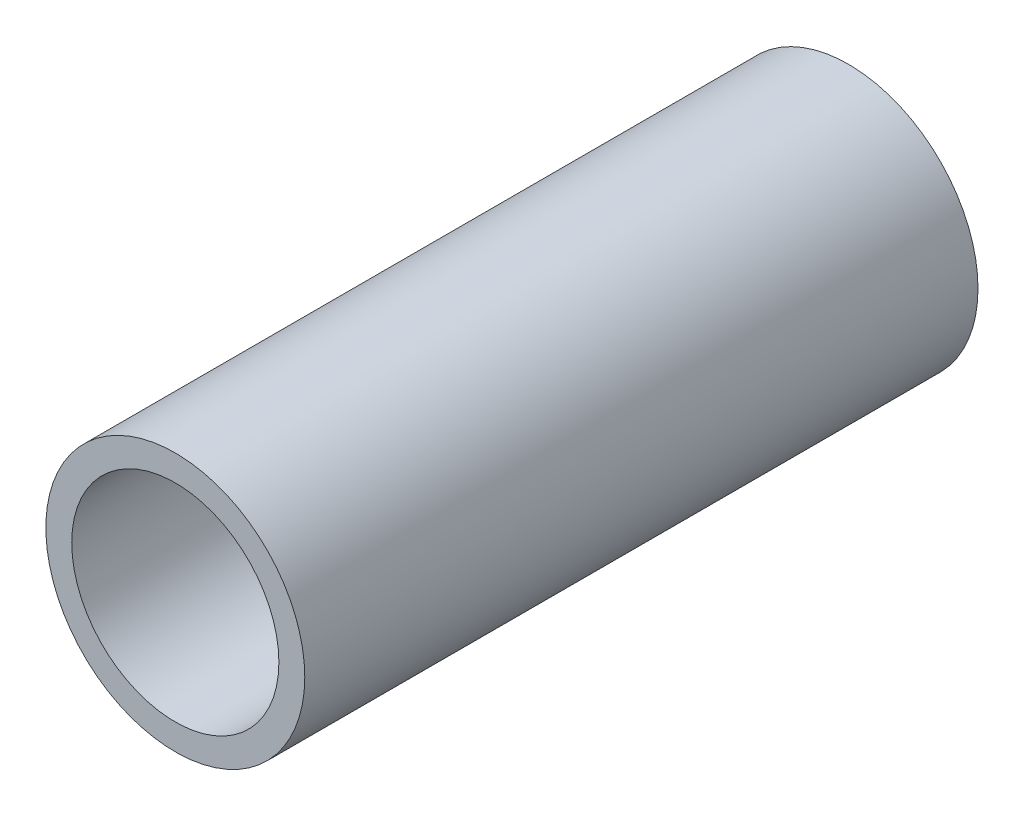
ISO-10303-21;
HEADER;
FILE_DESCRIPTION(('STEP AP214'),'2;1');
FILE_NAME('part.step','',(''),(''),'','','');
FILE_SCHEMA(('AUTOMOTIVE_DESIGN { 1 0 10303 214 1 1 1 1 }'));
ENDSEC;
DATA;
#1=APPLICATION_CONTEXT('core data for automotive mechanical design processes');
#2=APPLICATION_PROTOCOL_DEFINITION('international standard','automotive_design',2000,#1);
#3=PRODUCT_CONTEXT('',#1,'mechanical');
#4=PRODUCT('Part','Part','',(#3));
#5=PRODUCT_RELATED_PRODUCT_CATEGORY('part','',(#4));
#6=PRODUCT_DEFINITION_FORMATION('','',#4);
#7=PRODUCT_DEFINITION_CONTEXT('part definition',#1,'design');
#8=PRODUCT_DEFINITION('design','',#6,#7);
#9=PRODUCT_DEFINITION_SHAPE('','',#8);
#10=(LENGTH_UNIT() NAMED_UNIT(*) SI_UNIT(.MILLI.,.METRE.));
#11=(NAMED_UNIT(*) PLANE_ANGLE_UNIT() SI_UNIT($,.RADIAN.));
#12=(NAMED_UNIT(*) SI_UNIT($,.STERADIAN.) SOLID_ANGLE_UNIT());
#13=UNCERTAINTY_MEASURE_WITH_UNIT(LENGTH_MEASURE(1.E-05),#10,'distance_accuracy_value','');
#14=(GEOMETRIC_REPRESENTATION_CONTEXT(3) GLOBAL_UNCERTAINTY_ASSIGNED_CONTEXT((#13)) GLOBAL_UNIT_ASSIGNED_CONTEXT((#10,
#11,#12)) REPRESENTATION_CONTEXT('',''));
#15=CARTESIAN_POINT('',(0.,0.,0.));
#16=DIRECTION('',(0.,0.,1.));
#17=DIRECTION('',(1.,0.,0.));
#18=AXIS2_PLACEMENT_3D('',#15,#16,#17);
#19=CARTESIAN_POINT('',(0.,0.,13.));
#20=DIRECTION('',(0.,0.,-1.));
#21=DIRECTION('',(-1.,0.,0.));
#22=AXIS2_PLACEMENT_3D('',#19,#20,#21);
#23=CYLINDRICAL_SURFACE('',#22,2.5);
#24=CARTESIAN_POINT('',(0.,0.,13.));
#25=DIRECTION('',(0.,0.,1.));
#26=DIRECTION('',(1.,0.,0.));
#27=AXIS2_PLACEMENT_3D('',#24,#25,#26);
#28=CIRCLE('',#27,2.5);
#29=CARTESIAN_POINT('',(2.5,0.,13.));
#30=VERTEX_POINT('',#29);
#31=EDGE_CURVE('E12',#30,#30,#28,.T.);
#32=ORIENTED_EDGE('',*,*,#31,.F.);
#33=EDGE_LOOP('',(#32));
#34=FACE_BOUND('',#33,.T.);
#35=CARTESIAN_POINT('',(0.,0.,0.));
#36=DIRECTION('',(0.,0.,1.));
#37=DIRECTION('',(1.,0.,0.));
#38=AXIS2_PLACEMENT_3D('',#35,#36,#37);
#39=CIRCLE('',#38,2.5);
#40=CARTESIAN_POINT('',(2.5,0.,0.));
#41=VERTEX_POINT('',#40);
#42=EDGE_CURVE('E51',#41,#41,#39,.T.);
#43=ORIENTED_EDGE('',*,*,#42,.T.);
#44=EDGE_LOOP('',(#43));
#45=FACE_BOUND('',#44,.T.);
#46=ADVANCED_FACE('F48',(#34,#45),#23,.T.);
#47=CARTESIAN_POINT('',(0.,0.,13.));
#48=DIRECTION('',(0.,0.,1.));
#49=DIRECTION('',(1.,0.,0.));
#50=AXIS2_PLACEMENT_3D('',#47,#48,#49);
#51=PLANE('',#50);
#52=CARTESIAN_POINT('',(0.,0.,13.));
#53=DIRECTION('',(0.,0.,1.));
#54=DIRECTION('',(1.,0.,0.));
#55=AXIS2_PLACEMENT_3D('',#52,#53,#54);
#56=CIRCLE('',#55,2.);
#57=CARTESIAN_POINT('',(2.,0.,13.));
#58=VERTEX_POINT('',#57);
#59=EDGE_CURVE('E63',#58,#58,#56,.T.);
#60=ORIENTED_EDGE('',*,*,#59,.F.);
#61=EDGE_LOOP('',(#60));
#62=FACE_BOUND('',#61,.T.);
#63=ORIENTED_EDGE('',*,*,#31,.T.);
#64=EDGE_LOOP('',(#63));
#65=FACE_BOUND('',#64,.T.);
#66=ADVANCED_FACE('F79',(#62,#65),#51,.T.);
#67=CARTESIAN_POINT('',(0.,0.,0.));
#68=DIRECTION('',(0.,0.,1.));
#69=DIRECTION('',(1.,0.,0.));
#70=AXIS2_PLACEMENT_3D('',#67,#68,#69);
#71=PLANE('',#70);
#72=CARTESIAN_POINT('',(0.,0.,0.));
#73=DIRECTION('',(0.,0.,1.));
#74=DIRECTION('',(1.,0.,0.));
#75=AXIS2_PLACEMENT_3D('',#72,#73,#74);
#76=CIRCLE('',#75,2.);
#77=CARTESIAN_POINT('',(2.,0.,0.));
#78=VERTEX_POINT('',#77);
#79=EDGE_CURVE('E61',#78,#78,#76,.T.);
#80=ORIENTED_EDGE('',*,*,#79,.T.);
#81=EDGE_LOOP('',(#80));
#82=FACE_BOUND('',#81,.T.);
#83=ORIENTED_EDGE('',*,*,#42,.F.);
#84=EDGE_LOOP('',(#83));
#85=FACE_BOUND('',#84,.T.);
#86=ADVANCED_FACE('F70',(#82,#85),#71,.F.);
#87=CARTESIAN_POINT('',(0.,0.,0.));
#88=DIRECTION('',(0.,0.,1.));
#89=DIRECTION('',(1.,0.,0.));
#90=AXIS2_PLACEMENT_3D('',#87,#88,#89);
#91=CYLINDRICAL_SURFACE('',#90,2.);
#92=ORIENTED_EDGE('',*,*,#79,.F.);
#93=EDGE_LOOP('',(#92));
#94=FACE_BOUND('',#93,.T.);
#95=ORIENTED_EDGE('',*,*,#59,.T.);
#96=EDGE_LOOP('',(#95));
#97=FACE_BOUND('',#96,.T.);
#98=ADVANCED_FACE('F73',(#94,#97),#91,.F.);
#99=CLOSED_SHELL('',(#46,#66,#86,#98));
#100=MANIFOLD_SOLID_BREP('B2',#99);
#101=ADVANCED_BREP_SHAPE_REPRESENTATION('',(#18,#100),#14);
#102=SHAPE_DEFINITION_REPRESENTATION(#9,#101);
ENDSEC;
END-ISO-10303-21;
